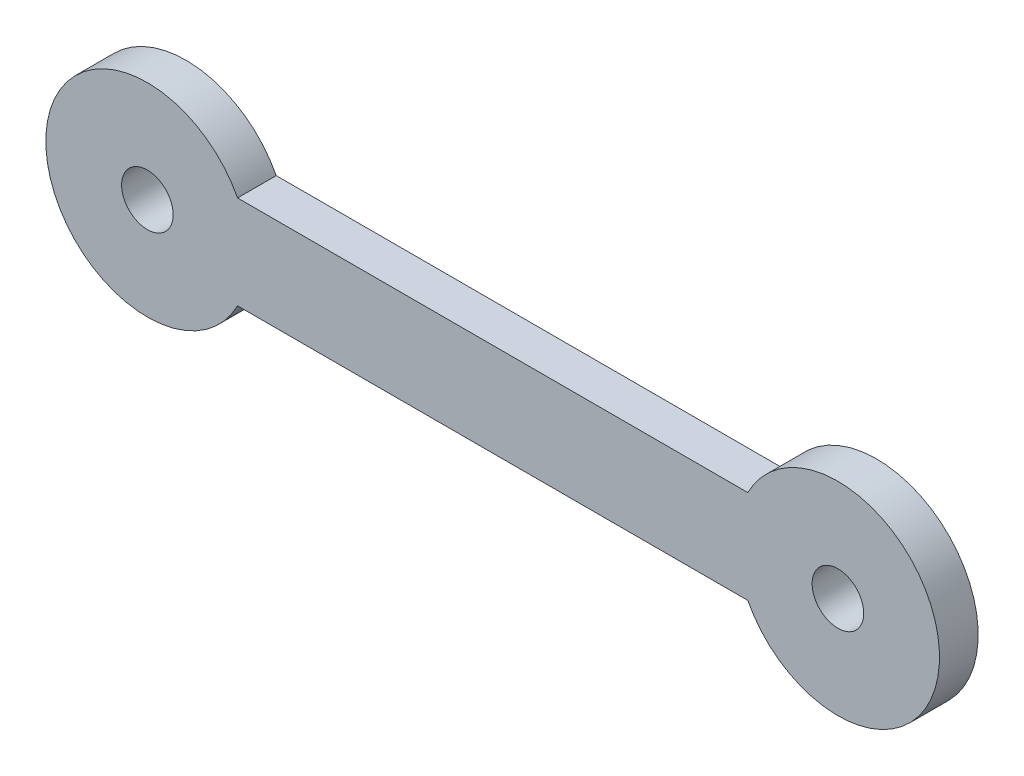
ISO-10303-21;
HEADER;
FILE_DESCRIPTION(('STEP AP214'),'2;1');
FILE_NAME('part.step','',(''),(''),'','','');
FILE_SCHEMA(('AUTOMOTIVE_DESIGN { 1 0 10303 214 1 1 1 1 }'));
ENDSEC;
DATA;
#1=APPLICATION_CONTEXT('core data for automotive mechanical design processes');
#2=APPLICATION_PROTOCOL_DEFINITION('international standard','automotive_design',2000,#1);
#3=PRODUCT_CONTEXT('',#1,'mechanical');
#4=PRODUCT('Part','Part','',(#3));
#5=PRODUCT_RELATED_PRODUCT_CATEGORY('part','',(#4));
#6=PRODUCT_DEFINITION_FORMATION('','',#4);
#7=PRODUCT_DEFINITION_CONTEXT('part definition',#1,'design');
#8=PRODUCT_DEFINITION('design','',#6,#7);
#9=PRODUCT_DEFINITION_SHAPE('','',#8);
#10=(LENGTH_UNIT() NAMED_UNIT(*) SI_UNIT(.MILLI.,.METRE.));
#11=(NAMED_UNIT(*) PLANE_ANGLE_UNIT() SI_UNIT($,.RADIAN.));
#12=(NAMED_UNIT(*) SI_UNIT($,.STERADIAN.) SOLID_ANGLE_UNIT());
#13=UNCERTAINTY_MEASURE_WITH_UNIT(LENGTH_MEASURE(1.E-05),#10,'distance_accuracy_value','');
#14=(GEOMETRIC_REPRESENTATION_CONTEXT(3) GLOBAL_UNCERTAINTY_ASSIGNED_CONTEXT((#13)) GLOBAL_UNIT_ASSIGNED_CONTEXT((#10,
#11,#12)) REPRESENTATION_CONTEXT('',''));
#15=CARTESIAN_POINT('',(0.,0.,0.));
#16=DIRECTION('',(0.,0.,1.));
#17=DIRECTION('',(1.,0.,0.));
#18=AXIS2_PLACEMENT_3D('',#15,#16,#17);
#19=CARTESIAN_POINT('',(169.99966,0.,9.525));
#20=DIRECTION('',(0.,0.,1.));
#21=DIRECTION('',(1.,0.,0.));
#22=AXIS2_PLACEMENT_3D('',#19,#20,#21);
#23=PLANE('',#22);
#24=CARTESIAN_POINT('',(0.,0.,9.525));
#25=DIRECTION('',(0.,0.,1.));
#26=DIRECTION('',(1.,0.,0.));
#27=AXIS2_PLACEMENT_3D('',#24,#25,#26);
#28=CIRCLE('',#27,6.35);
#29=CARTESIAN_POINT('',(6.35,0.,9.525));
#30=VERTEX_POINT('',#29);
#31=EDGE_CURVE('E98',#30,#30,#28,.T.);
#32=ORIENTED_EDGE('',*,*,#31,.F.);
#33=EDGE_LOOP('',(#32));
#34=FACE_BOUND('',#33,.T.);
#35=CARTESIAN_POINT('',(169.99966,0.,9.525));
#36=DIRECTION('',(0.,0.,1.));
#37=DIRECTION('',(1.,0.,0.));
#38=AXIS2_PLACEMENT_3D('',#35,#36,#37);
#39=CIRCLE('',#38,25.00122);
#40=CARTESIAN_POINT('',(147.800235424892,-11.49985,9.525));
#41=VERTEX_POINT('',#40);
#42=CARTESIAN_POINT('',(147.800235424892,11.49985,9.525));
#43=VERTEX_POINT('',#42);
#44=EDGE_CURVE('E83',#41,#43,#39,.T.);
#45=ORIENTED_EDGE('',*,*,#44,.T.);
#46=DIRECTION('',(-1.,0.,0.));
#47=VECTOR('',#46,1.);
#48=CARTESIAN_POINT('',(22.1994245751078,11.49985,9.525));
#49=LINE('',#48,#47);
#50=CARTESIAN_POINT('',(22.1994245751078,11.49985,9.525));
#51=VERTEX_POINT('',#50);
#52=EDGE_CURVE('E78',#43,#51,#49,.T.);
#53=ORIENTED_EDGE('',*,*,#52,.T.);
#54=CARTESIAN_POINT('',(0.,0.,9.525));
#55=DIRECTION('',(0.,0.,1.));
#56=DIRECTION('',(1.,0.,0.));
#57=AXIS2_PLACEMENT_3D('',#54,#55,#56);
#58=CIRCLE('',#57,25.00122);
#59=CARTESIAN_POINT('',(22.1994245751078,-11.49985,9.525));
#60=VERTEX_POINT('',#59);
#61=EDGE_CURVE('E81',#51,#60,#58,.T.);
#62=ORIENTED_EDGE('',*,*,#61,.T.);
#63=DIRECTION('',(1.,0.,0.));
#64=VECTOR('',#63,1.);
#65=CARTESIAN_POINT('',(22.1994245751078,-11.49985,9.525));
#66=LINE('',#65,#64);
#67=EDGE_CURVE('E48',#60,#41,#66,.T.);
#68=ORIENTED_EDGE('',*,*,#67,.T.);
#69=EDGE_LOOP('',(#45,#53,#62,#68));
#70=FACE_BOUND('',#69,.T.);
#71=CARTESIAN_POINT('',(169.99966,0.,9.525));
#72=DIRECTION('',(0.,0.,1.));
#73=DIRECTION('',(1.,0.,0.));
#74=AXIS2_PLACEMENT_3D('',#71,#72,#73);
#75=CIRCLE('',#74,6.35);
#76=CARTESIAN_POINT('',(176.34966,0.,9.525));
#77=VERTEX_POINT('',#76);
#78=EDGE_CURVE('E113',#77,#77,#75,.T.);
#79=ORIENTED_EDGE('',*,*,#78,.F.);
#80=EDGE_LOOP('',(#79));
#81=FACE_BOUND('',#80,.T.);
#82=ADVANCED_FACE('F31',(#34,#70,#81),#23,.T.);
#83=CARTESIAN_POINT('',(169.99966,0.,0.));
#84=DIRECTION('',(0.,0.,1.));
#85=DIRECTION('',(1.,0.,0.));
#86=AXIS2_PLACEMENT_3D('',#83,#84,#85);
#87=PLANE('',#86);
#88=CARTESIAN_POINT('',(0.,0.,0.));
#89=DIRECTION('',(0.,0.,1.));
#90=DIRECTION('',(1.,0.,0.));
#91=AXIS2_PLACEMENT_3D('',#88,#89,#90);
#92=CIRCLE('',#91,6.35);
#93=CARTESIAN_POINT('',(6.35,0.,0.));
#94=VERTEX_POINT('',#93);
#95=EDGE_CURVE('E110',#94,#94,#92,.T.);
#96=ORIENTED_EDGE('',*,*,#95,.T.);
#97=EDGE_LOOP('',(#96));
#98=FACE_BOUND('',#97,.T.);
#99=CARTESIAN_POINT('',(169.99966,0.,0.));
#100=DIRECTION('',(0.,0.,1.));
#101=DIRECTION('',(1.,0.,0.));
#102=AXIS2_PLACEMENT_3D('',#99,#100,#101);
#103=CIRCLE('',#102,25.00122);
#104=CARTESIAN_POINT('',(147.800235424892,-11.49985,0.));
#105=VERTEX_POINT('',#104);
#106=CARTESIAN_POINT('',(147.800235424892,11.49985,0.));
#107=VERTEX_POINT('',#106);
#108=EDGE_CURVE('E95',#105,#107,#103,.T.);
#109=ORIENTED_EDGE('',*,*,#108,.F.);
#110=DIRECTION('',(1.,0.,0.));
#111=VECTOR('',#110,1.);
#112=CARTESIAN_POINT('',(22.1994245751078,-11.49985,0.));
#113=LINE('',#112,#111);
#114=CARTESIAN_POINT('',(22.1994245751078,-11.49985,0.));
#115=VERTEX_POINT('',#114);
#116=EDGE_CURVE('E71',#115,#105,#113,.T.);
#117=ORIENTED_EDGE('',*,*,#116,.F.);
#118=CARTESIAN_POINT('',(0.,0.,0.));
#119=DIRECTION('',(0.,0.,1.));
#120=DIRECTION('',(1.,0.,0.));
#121=AXIS2_PLACEMENT_3D('',#118,#119,#120);
#122=CIRCLE('',#121,25.00122);
#123=CARTESIAN_POINT('',(22.1994245751078,11.49985,0.));
#124=VERTEX_POINT('',#123);
#125=EDGE_CURVE('E65',#124,#115,#122,.T.);
#126=ORIENTED_EDGE('',*,*,#125,.F.);
#127=DIRECTION('',(-1.,0.,0.));
#128=VECTOR('',#127,1.);
#129=CARTESIAN_POINT('',(22.1994245751078,11.49985,0.));
#130=LINE('',#129,#128);
#131=EDGE_CURVE('E87',#107,#124,#130,.T.);
#132=ORIENTED_EDGE('',*,*,#131,.F.);
#133=EDGE_LOOP('',(#109,#117,#126,#132));
#134=FACE_BOUND('',#133,.T.);
#135=CARTESIAN_POINT('',(169.99966,0.,0.));
#136=DIRECTION('',(0.,0.,1.));
#137=DIRECTION('',(1.,0.,0.));
#138=AXIS2_PLACEMENT_3D('',#135,#136,#137);
#139=CIRCLE('',#138,6.35);
#140=CARTESIAN_POINT('',(176.34966,0.,0.));
#141=VERTEX_POINT('',#140);
#142=EDGE_CURVE('E116',#141,#141,#139,.T.);
#143=ORIENTED_EDGE('',*,*,#142,.T.);
#144=EDGE_LOOP('',(#143));
#145=FACE_BOUND('',#144,.T.);
#146=ADVANCED_FACE('F106',(#98,#134,#145),#87,.F.);
#147=CARTESIAN_POINT('',(169.99966,0.,9.525));
#148=DIRECTION('',(0.,0.,-1.));
#149=DIRECTION('',(-1.,0.,0.));
#150=AXIS2_PLACEMENT_3D('',#147,#148,#149);
#151=CYLINDRICAL_SURFACE('',#150,25.00122);
#152=ORIENTED_EDGE('',*,*,#108,.T.);
#153=DIRECTION('',(0.,0.,-1.));
#154=VECTOR('',#153,1.);
#155=CARTESIAN_POINT('',(147.800235424892,11.49985,9.525));
#156=LINE('',#155,#154);
#157=EDGE_CURVE('E11',#43,#107,#156,.T.);
#158=ORIENTED_EDGE('',*,*,#157,.F.);
#159=ORIENTED_EDGE('',*,*,#44,.F.);
#160=DIRECTION('',(0.,0.,-1.));
#161=VECTOR('',#160,1.);
#162=CARTESIAN_POINT('',(147.800235424892,-11.49985,9.525));
#163=LINE('',#162,#161);
#164=EDGE_CURVE('E91',#41,#105,#163,.T.);
#165=ORIENTED_EDGE('',*,*,#164,.T.);
#166=EDGE_LOOP('',(#152,#158,#159,#165));
#167=FACE_BOUND('',#166,.T.);
#168=ADVANCED_FACE('F33',(#167),#151,.T.);
#169=CARTESIAN_POINT('',(22.1994245751078,11.49985,9.525));
#170=DIRECTION('',(0.,-1.,0.));
#171=DIRECTION('',(1.,0.,0.));
#172=AXIS2_PLACEMENT_3D('',#169,#170,#171);
#173=PLANE('',#172);
#174=ORIENTED_EDGE('',*,*,#131,.T.);
#175=DIRECTION('',(0.,0.,-1.));
#176=VECTOR('',#175,1.);
#177=CARTESIAN_POINT('',(22.1994245751078,11.49985,9.525));
#178=LINE('',#177,#176);
#179=EDGE_CURVE('E40',#51,#124,#178,.T.);
#180=ORIENTED_EDGE('',*,*,#179,.F.);
#181=ORIENTED_EDGE('',*,*,#52,.F.);
#182=ORIENTED_EDGE('',*,*,#157,.T.);
#183=EDGE_LOOP('',(#174,#180,#181,#182));
#184=FACE_BOUND('',#183,.T.);
#185=ADVANCED_FACE('F86',(#184),#173,.F.);
#186=CARTESIAN_POINT('',(0.,0.,9.525));
#187=DIRECTION('',(0.,0.,-1.));
#188=DIRECTION('',(-1.,0.,0.));
#189=AXIS2_PLACEMENT_3D('',#186,#187,#188);
#190=CYLINDRICAL_SURFACE('',#189,25.00122);
#191=ORIENTED_EDGE('',*,*,#125,.T.);
#192=DIRECTION('',(0.,0.,-1.));
#193=VECTOR('',#192,1.);
#194=CARTESIAN_POINT('',(22.1994245751078,-11.49985,9.525));
#195=LINE('',#194,#193);
#196=EDGE_CURVE('E88',#60,#115,#195,.T.);
#197=ORIENTED_EDGE('',*,*,#196,.F.);
#198=ORIENTED_EDGE('',*,*,#61,.F.);
#199=ORIENTED_EDGE('',*,*,#179,.T.);
#200=EDGE_LOOP('',(#191,#197,#198,#199));
#201=FACE_BOUND('',#200,.T.);
#202=ADVANCED_FACE('F89',(#201),#190,.T.);
#203=CARTESIAN_POINT('',(22.1994245751078,-11.49985,9.525));
#204=DIRECTION('',(0.,1.,0.));
#205=DIRECTION('',(0.,0.,1.));
#206=AXIS2_PLACEMENT_3D('',#203,#204,#205);
#207=PLANE('',#206);
#208=ORIENTED_EDGE('',*,*,#116,.T.);
#209=ORIENTED_EDGE('',*,*,#164,.F.);
#210=ORIENTED_EDGE('',*,*,#67,.F.);
#211=ORIENTED_EDGE('',*,*,#196,.T.);
#212=EDGE_LOOP('',(#208,#209,#210,#211));
#213=FACE_BOUND('',#212,.T.);
#214=ADVANCED_FACE('F103',(#213),#207,.F.);
#215=CARTESIAN_POINT('',(0.,0.,9.525));
#216=DIRECTION('',(0.,0.,-1.));
#217=DIRECTION('',(-1.,0.,0.));
#218=AXIS2_PLACEMENT_3D('',#215,#216,#217);
#219=CYLINDRICAL_SURFACE('',#218,6.35);
#220=ORIENTED_EDGE('',*,*,#31,.T.);
#221=EDGE_LOOP('',(#220));
#222=FACE_BOUND('',#221,.T.);
#223=ORIENTED_EDGE('',*,*,#95,.F.);
#224=EDGE_LOOP('',(#223));
#225=FACE_BOUND('',#224,.T.);
#226=ADVANCED_FACE('F134',(#222,#225),#219,.F.);
#227=CARTESIAN_POINT('',(169.99966,0.,9.525));
#228=DIRECTION('',(0.,0.,-1.));
#229=DIRECTION('',(-1.,0.,0.));
#230=AXIS2_PLACEMENT_3D('',#227,#228,#229);
#231=CYLINDRICAL_SURFACE('',#230,6.35);
#232=ORIENTED_EDGE('',*,*,#78,.T.);
#233=EDGE_LOOP('',(#232));
#234=FACE_BOUND('',#233,.T.);
#235=ORIENTED_EDGE('',*,*,#142,.F.);
#236=EDGE_LOOP('',(#235));
#237=FACE_BOUND('',#236,.T.);
#238=ADVANCED_FACE('F122',(#234,#237),#231,.F.);
#239=CLOSED_SHELL('',(#82,#146,#168,#185,#202,#214,#226,#238));
#240=MANIFOLD_SOLID_BREP('B2',#239);
#241=ADVANCED_BREP_SHAPE_REPRESENTATION('',(#18,#240),#14);
#242=SHAPE_DEFINITION_REPRESENTATION(#9,#241);
ENDSEC;
END-ISO-10303-21;
